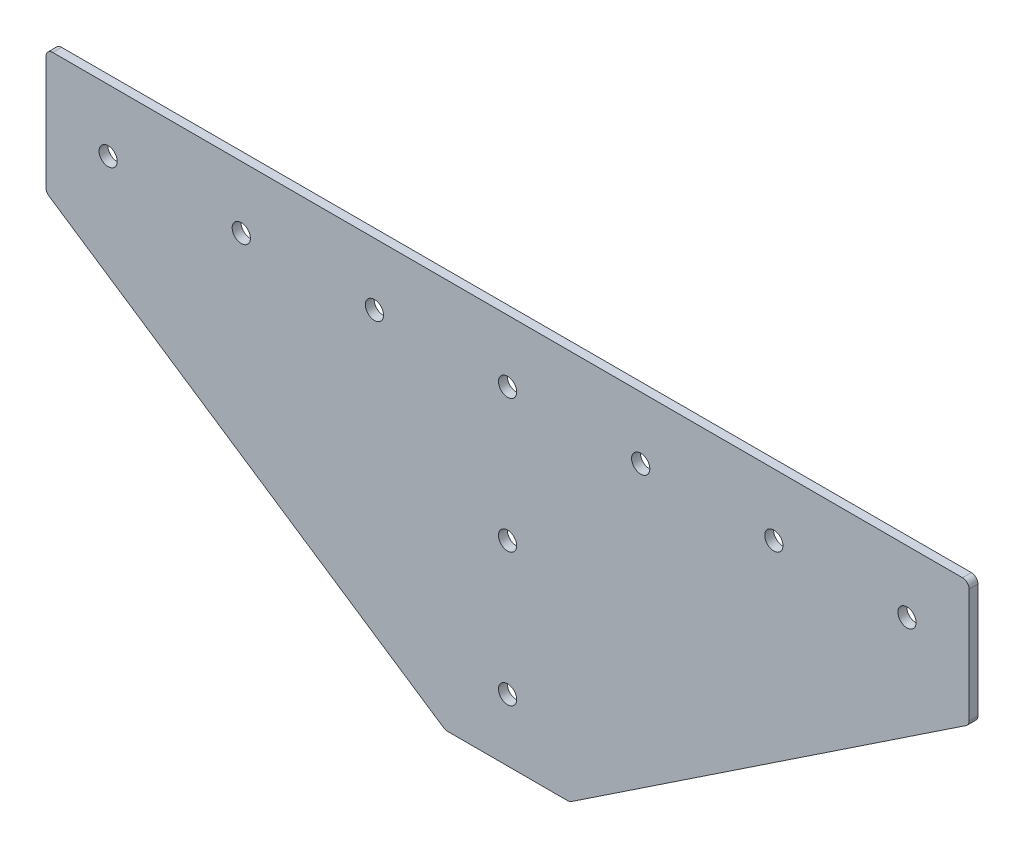
ISO-10303-21;
HEADER;
FILE_DESCRIPTION(('STEP AP214'),'2;1');
FILE_NAME('part.step','',(''),(''),'','','');
FILE_SCHEMA(('AUTOMOTIVE_DESIGN { 1 0 10303 214 1 1 1 1 }'));
ENDSEC;
DATA;
#1=APPLICATION_CONTEXT('core data for automotive mechanical design processes');
#2=APPLICATION_PROTOCOL_DEFINITION('international standard','automotive_design',2000,#1);
#3=PRODUCT_CONTEXT('',#1,'mechanical');
#4=PRODUCT('Part','Part','',(#3));
#5=PRODUCT_RELATED_PRODUCT_CATEGORY('part','',(#4));
#6=PRODUCT_DEFINITION_FORMATION('','',#4);
#7=PRODUCT_DEFINITION_CONTEXT('part definition',#1,'design');
#8=PRODUCT_DEFINITION('design','',#6,#7);
#9=PRODUCT_DEFINITION_SHAPE('','',#8);
#10=(LENGTH_UNIT() NAMED_UNIT(*) SI_UNIT(.MILLI.,.METRE.));
#11=(NAMED_UNIT(*) PLANE_ANGLE_UNIT() SI_UNIT($,.RADIAN.));
#12=(NAMED_UNIT(*) SI_UNIT($,.STERADIAN.) SOLID_ANGLE_UNIT());
#13=UNCERTAINTY_MEASURE_WITH_UNIT(LENGTH_MEASURE(1.E-05),#10,'distance_accuracy_value','');
#14=(GEOMETRIC_REPRESENTATION_CONTEXT(3) GLOBAL_UNCERTAINTY_ASSIGNED_CONTEXT((#13)) GLOBAL_UNIT_ASSIGNED_CONTEXT((#10,
#11,#12)) REPRESENTATION_CONTEXT('',''));
#15=CARTESIAN_POINT('',(0.,0.,0.));
#16=DIRECTION('',(0.,0.,1.));
#17=DIRECTION('',(1.,0.,0.));
#18=AXIS2_PLACEMENT_3D('',#15,#16,#17);
#19=CARTESIAN_POINT('',(0.,0.,4.));
#20=DIRECTION('',(0.,0.,1.));
#21=DIRECTION('',(1.,0.,0.));
#22=AXIS2_PLACEMENT_3D('',#19,#20,#21);
#23=PLANE('',#22);
#24=CARTESIAN_POINT('',(360.,0.,4.));
#25=DIRECTION('',(0.,0.,1.));
#26=DIRECTION('',(1.,0.,0.));
#27=AXIS2_PLACEMENT_3D('',#24,#25,#26);
#28=CIRCLE('',#27,4.09999999999999);
#29=CARTESIAN_POINT('',(364.1,0.,4.));
#30=VERTEX_POINT('',#29);
#31=EDGE_CURVE('E244',#30,#30,#28,.T.);
#32=ORIENTED_EDGE('',*,*,#31,.F.);
#33=EDGE_LOOP('',(#32));
#34=FACE_BOUND('',#33,.T.);
#35=CARTESIAN_POINT('',(240.,0.,4.));
#36=DIRECTION('',(0.,0.,1.));
#37=DIRECTION('',(1.,0.,0.));
#38=AXIS2_PLACEMENT_3D('',#35,#36,#37);
#39=CIRCLE('',#38,4.09999999999999);
#40=CARTESIAN_POINT('',(244.1,0.,4.));
#41=VERTEX_POINT('',#40);
#42=EDGE_CURVE('E232',#41,#41,#39,.T.);
#43=ORIENTED_EDGE('',*,*,#42,.F.);
#44=EDGE_LOOP('',(#43));
#45=FACE_BOUND('',#44,.T.);
#46=CARTESIAN_POINT('',(180.000000000001,-119.999999999999,4.));
#47=DIRECTION('',(0.,0.,1.));
#48=DIRECTION('',(1.,0.,0.));
#49=AXIS2_PLACEMENT_3D('',#46,#47,#48);
#50=CIRCLE('',#49,4.09999999999998);
#51=CARTESIAN_POINT('',(184.100000000001,-119.999999999999,4.));
#52=VERTEX_POINT('',#51);
#53=EDGE_CURVE('E220',#52,#52,#50,.T.);
#54=ORIENTED_EDGE('',*,*,#53,.F.);
#55=EDGE_LOOP('',(#54));
#56=FACE_BOUND('',#55,.T.);
#57=CARTESIAN_POINT('',(60.,0.,4.));
#58=DIRECTION('',(0.,0.,1.));
#59=DIRECTION('',(1.,0.,0.));
#60=AXIS2_PLACEMENT_3D('',#57,#58,#59);
#61=CIRCLE('',#60,4.09999999999999);
#62=CARTESIAN_POINT('',(64.1,0.,4.));
#63=VERTEX_POINT('',#62);
#64=EDGE_CURVE('E209',#63,#63,#61,.T.);
#65=ORIENTED_EDGE('',*,*,#64,.F.);
#66=EDGE_LOOP('',(#65));
#67=FACE_BOUND('',#66,.T.);
#68=DIRECTION('',(0.832050294337844,0.554700196225229,0.));
#69=VECTOR('',#68,1.);
#70=CARTESIAN_POINT('',(388.,-28.,4.));
#71=LINE('',#70,#69);
#72=CARTESIAN_POINT('',(208.75577367548,-147.496150883014,4.));
#73=VERTEX_POINT('',#72);
#74=CARTESIAN_POINT('',(386.664100588676,-28.8905996075496,4.));
#75=VERTEX_POINT('',#74);
#76=EDGE_CURVE('E266',#73,#75,#71,.T.);
#77=ORIENTED_EDGE('',*,*,#76,.T.);
#78=CARTESIAN_POINT('',(385.,-26.3944487245361,4.));
#79=DIRECTION('',(0.,0.,1.));
#80=DIRECTION('',(1.,0.,0.));
#81=AXIS2_PLACEMENT_3D('',#78,#79,#80);
#82=CIRCLE('',#81,3.);
#83=CARTESIAN_POINT('',(388.,-26.3944487245361,4.));
#84=VERTEX_POINT('',#83);
#85=EDGE_CURVE('E163',#75,#84,#82,.T.);
#86=ORIENTED_EDGE('',*,*,#85,.T.);
#87=DIRECTION('',(0.,1.,0.));
#88=VECTOR('',#87,1.);
#89=CARTESIAN_POINT('',(388.,28.,4.));
#90=LINE('',#89,#88);
#91=CARTESIAN_POINT('',(388.,25.,4.));
#92=VERTEX_POINT('',#91);
#93=EDGE_CURVE('E124',#84,#92,#90,.T.);
#94=ORIENTED_EDGE('',*,*,#93,.T.);
#95=CARTESIAN_POINT('',(385.,25.,4.));
#96=DIRECTION('',(0.,0.,1.));
#97=DIRECTION('',(1.,0.,0.));
#98=AXIS2_PLACEMENT_3D('',#95,#96,#97);
#99=CIRCLE('',#98,3.);
#100=CARTESIAN_POINT('',(385.,28.,4.));
#101=VERTEX_POINT('',#100);
#102=EDGE_CURVE('E36',#92,#101,#99,.T.);
#103=ORIENTED_EDGE('',*,*,#102,.T.);
#104=DIRECTION('',(-1.,0.,0.));
#105=VECTOR('',#104,1.);
#106=CARTESIAN_POINT('',(-28.,28.,4.));
#107=LINE('',#106,#105);
#108=CARTESIAN_POINT('',(-25.,28.,4.));
#109=VERTEX_POINT('',#108);
#110=EDGE_CURVE('E141',#101,#109,#107,.T.);
#111=ORIENTED_EDGE('',*,*,#110,.T.);
#112=CARTESIAN_POINT('',(-25.,25.,4.));
#113=DIRECTION('',(0.,0.,1.));
#114=DIRECTION('',(1.,0.,0.));
#115=AXIS2_PLACEMENT_3D('',#112,#113,#114);
#116=CIRCLE('',#115,3.);
#117=CARTESIAN_POINT('',(-28.,25.,4.));
#118=VERTEX_POINT('',#117);
#119=EDGE_CURVE('E155',#109,#118,#116,.T.);
#120=ORIENTED_EDGE('',*,*,#119,.T.);
#121=DIRECTION('',(0.,-1.,0.));
#122=VECTOR('',#121,1.);
#123=CARTESIAN_POINT('',(-28.,28.,4.));
#124=LINE('',#123,#122);
#125=CARTESIAN_POINT('',(-28.,-26.394448724536,4.));
#126=VERTEX_POINT('',#125);
#127=EDGE_CURVE('E134',#118,#126,#124,.T.);
#128=ORIENTED_EDGE('',*,*,#127,.T.);
#129=CARTESIAN_POINT('',(-25.,-26.394448724536,4.));
#130=DIRECTION('',(0.,0.,1.));
#131=DIRECTION('',(1.,0.,0.));
#132=AXIS2_PLACEMENT_3D('',#129,#130,#131);
#133=CIRCLE('',#132,3.);
#134=CARTESIAN_POINT('',(-26.6641005886757,-28.8905996075495,4.));
#135=VERTEX_POINT('',#134);
#136=EDGE_CURVE('E157',#126,#135,#133,.T.);
#137=ORIENTED_EDGE('',*,*,#136,.T.);
#138=DIRECTION('',(0.832050294337844,-0.554700196225229,0.));
#139=VECTOR('',#138,1.);
#140=CARTESIAN_POINT('',(-28.,-28.,4.));
#141=LINE('',#140,#139);
#142=CARTESIAN_POINT('',(151.24422632452,-147.496150883014,4.));
#143=VERTEX_POINT('',#142);
#144=EDGE_CURVE('E261',#135,#143,#141,.T.);
#145=ORIENTED_EDGE('',*,*,#144,.T.);
#146=CARTESIAN_POINT('',(152.908326913196,-145.,4.));
#147=DIRECTION('',(0.,0.,1.));
#148=DIRECTION('',(1.,0.,0.));
#149=AXIS2_PLACEMENT_3D('',#146,#147,#148);
#150=CIRCLE('',#149,3.);
#151=CARTESIAN_POINT('',(152.908326913196,-148.,4.));
#152=VERTEX_POINT('',#151);
#153=EDGE_CURVE('E159',#143,#152,#150,.T.);
#154=ORIENTED_EDGE('',*,*,#153,.T.);
#155=DIRECTION('',(1.,0.,0.));
#156=VECTOR('',#155,1.);
#157=CARTESIAN_POINT('',(152.,-148.,4.));
#158=LINE('',#157,#156);
#159=CARTESIAN_POINT('',(207.091673086804,-148.,4.));
#160=VERTEX_POINT('',#159);
#161=EDGE_CURVE('E195',#152,#160,#158,.T.);
#162=ORIENTED_EDGE('',*,*,#161,.T.);
#163=CARTESIAN_POINT('',(207.091673086804,-145.,4.));
#164=DIRECTION('',(0.,0.,1.));
#165=DIRECTION('',(1.,0.,0.));
#166=AXIS2_PLACEMENT_3D('',#163,#164,#165);
#167=CIRCLE('',#166,3.);
#168=EDGE_CURVE('E161',#160,#73,#167,.T.);
#169=ORIENTED_EDGE('',*,*,#168,.T.);
#170=EDGE_LOOP('',(#77,#86,#94,#103,#111,#120,#128,#137,#145,#154,#162,#169));
#171=FACE_BOUND('',#170,.T.);
#172=CARTESIAN_POINT('',(0.,0.,4.));
#173=DIRECTION('',(0.,0.,1.));
#174=DIRECTION('',(1.,0.,0.));
#175=AXIS2_PLACEMENT_3D('',#172,#173,#174);
#176=CIRCLE('',#175,4.1);
#177=CARTESIAN_POINT('',(4.1,0.,4.));
#178=VERTEX_POINT('',#177);
#179=EDGE_CURVE('E204',#178,#178,#176,.T.);
#180=ORIENTED_EDGE('',*,*,#179,.F.);
#181=EDGE_LOOP('',(#180));
#182=FACE_BOUND('',#181,.T.);
#183=CARTESIAN_POINT('',(120.,0.,4.));
#184=DIRECTION('',(0.,0.,1.));
#185=DIRECTION('',(1.,0.,0.));
#186=AXIS2_PLACEMENT_3D('',#183,#184,#185);
#187=CIRCLE('',#186,4.1);
#188=CARTESIAN_POINT('',(124.1,0.,4.));
#189=VERTEX_POINT('',#188);
#190=EDGE_CURVE('E214',#189,#189,#187,.T.);
#191=ORIENTED_EDGE('',*,*,#190,.F.);
#192=EDGE_LOOP('',(#191));
#193=FACE_BOUND('',#192,.T.);
#194=CARTESIAN_POINT('',(180.,0.,4.));
#195=DIRECTION('',(0.,0.,1.));
#196=DIRECTION('',(1.,0.,0.));
#197=AXIS2_PLACEMENT_3D('',#194,#195,#196);
#198=CIRCLE('',#197,4.09999999999999);
#199=CARTESIAN_POINT('',(184.1,0.,4.));
#200=VERTEX_POINT('',#199);
#201=EDGE_CURVE('E226',#200,#200,#198,.T.);
#202=ORIENTED_EDGE('',*,*,#201,.F.);
#203=EDGE_LOOP('',(#202));
#204=FACE_BOUND('',#203,.T.);
#205=CARTESIAN_POINT('',(300.,0.,4.));
#206=DIRECTION('',(0.,0.,1.));
#207=DIRECTION('',(1.,0.,0.));
#208=AXIS2_PLACEMENT_3D('',#205,#206,#207);
#209=CIRCLE('',#208,4.09999999999999);
#210=CARTESIAN_POINT('',(304.1,0.,4.));
#211=VERTEX_POINT('',#210);
#212=EDGE_CURVE('E238',#211,#211,#209,.T.);
#213=ORIENTED_EDGE('',*,*,#212,.F.);
#214=EDGE_LOOP('',(#213));
#215=FACE_BOUND('',#214,.T.);
#216=CARTESIAN_POINT('',(180.,-60.,4.));
#217=DIRECTION('',(0.,0.,1.));
#218=DIRECTION('',(1.,0.,0.));
#219=AXIS2_PLACEMENT_3D('',#216,#217,#218);
#220=CIRCLE('',#219,4.09999999999999);
#221=CARTESIAN_POINT('',(184.1,-60.,4.));
#222=VERTEX_POINT('',#221);
#223=EDGE_CURVE('E250',#222,#222,#220,.T.);
#224=ORIENTED_EDGE('',*,*,#223,.F.);
#225=EDGE_LOOP('',(#224));
#226=FACE_BOUND('',#225,.T.);
#227=ADVANCED_FACE('F16',(#34,#45,#56,#67,#171,#182,#193,#204,#215,#226),#23,.T.);
#228=CARTESIAN_POINT('',(0.,0.,0.));
#229=DIRECTION('',(0.,0.,1.));
#230=DIRECTION('',(1.,0.,0.));
#231=AXIS2_PLACEMENT_3D('',#228,#229,#230);
#232=PLANE('',#231);
#233=DIRECTION('',(0.,1.,0.));
#234=VECTOR('',#233,1.);
#235=CARTESIAN_POINT('',(388.,28.,0.));
#236=LINE('',#235,#234);
#237=CARTESIAN_POINT('',(388.,-26.3944487245361,0.));
#238=VERTEX_POINT('',#237);
#239=CARTESIAN_POINT('',(388.,25.,0.));
#240=VERTEX_POINT('',#239);
#241=EDGE_CURVE('E122',#238,#240,#236,.T.);
#242=ORIENTED_EDGE('',*,*,#241,.F.);
#243=CARTESIAN_POINT('',(385.,-26.3944487245361,0.));
#244=DIRECTION('',(0.,0.,1.));
#245=DIRECTION('',(1.,0.,0.));
#246=AXIS2_PLACEMENT_3D('',#243,#244,#245);
#247=CIRCLE('',#246,3.);
#248=CARTESIAN_POINT('',(386.664100588676,-28.8905996075496,0.));
#249=VERTEX_POINT('',#248);
#250=EDGE_CURVE('E105',#238,#249,#247,.F.);
#251=ORIENTED_EDGE('',*,*,#250,.T.);
#252=DIRECTION('',(-0.832050294337844,-0.554700196225229,0.));
#253=VECTOR('',#252,1.);
#254=CARTESIAN_POINT('',(388.,-28.,0.));
#255=LINE('',#254,#253);
#256=CARTESIAN_POINT('',(208.75577367548,-147.496150883014,0.));
#257=VERTEX_POINT('',#256);
#258=EDGE_CURVE('E264',#249,#257,#255,.T.);
#259=ORIENTED_EDGE('',*,*,#258,.T.);
#260=CARTESIAN_POINT('',(207.091673086804,-145.,0.));
#261=DIRECTION('',(0.,0.,1.));
#262=DIRECTION('',(1.,0.,0.));
#263=AXIS2_PLACEMENT_3D('',#260,#261,#262);
#264=CIRCLE('',#263,3.);
#265=CARTESIAN_POINT('',(207.091673086804,-148.,0.));
#266=VERTEX_POINT('',#265);
#267=EDGE_CURVE('E116',#257,#266,#264,.F.);
#268=ORIENTED_EDGE('',*,*,#267,.T.);
#269=DIRECTION('',(1.,0.,0.));
#270=VECTOR('',#269,1.);
#271=CARTESIAN_POINT('',(152.,-148.,0.));
#272=LINE('',#271,#270);
#273=CARTESIAN_POINT('',(152.908326913196,-148.,0.));
#274=VERTEX_POINT('',#273);
#275=EDGE_CURVE('E132',#274,#266,#272,.T.);
#276=ORIENTED_EDGE('',*,*,#275,.F.);
#277=CARTESIAN_POINT('',(152.908326913196,-145.,0.));
#278=DIRECTION('',(0.,0.,1.));
#279=DIRECTION('',(1.,0.,0.));
#280=AXIS2_PLACEMENT_3D('',#277,#278,#279);
#281=CIRCLE('',#280,3.);
#282=CARTESIAN_POINT('',(151.24422632452,-147.496150883014,0.));
#283=VERTEX_POINT('',#282);
#284=EDGE_CURVE('E148',#274,#283,#281,.F.);
#285=ORIENTED_EDGE('',*,*,#284,.T.);
#286=DIRECTION('',(-0.832050294337844,0.554700196225229,0.));
#287=VECTOR('',#286,1.);
#288=CARTESIAN_POINT('',(-28.,-28.,0.));
#289=LINE('',#288,#287);
#290=CARTESIAN_POINT('',(-26.6641005886757,-28.8905996075495,0.));
#291=VERTEX_POINT('',#290);
#292=EDGE_CURVE('E256',#283,#291,#289,.T.);
#293=ORIENTED_EDGE('',*,*,#292,.T.);
#294=CARTESIAN_POINT('',(-25.,-26.394448724536,0.));
#295=DIRECTION('',(0.,0.,1.));
#296=DIRECTION('',(1.,0.,0.));
#297=AXIS2_PLACEMENT_3D('',#294,#295,#296);
#298=CIRCLE('',#297,3.);
#299=CARTESIAN_POINT('',(-28.,-26.394448724536,0.));
#300=VERTEX_POINT('',#299);
#301=EDGE_CURVE('E146',#291,#300,#298,.F.);
#302=ORIENTED_EDGE('',*,*,#301,.T.);
#303=DIRECTION('',(0.,-1.,0.));
#304=VECTOR('',#303,1.);
#305=CARTESIAN_POINT('',(-28.,28.,0.));
#306=LINE('',#305,#304);
#307=CARTESIAN_POINT('',(-28.,25.,0.));
#308=VERTEX_POINT('',#307);
#309=EDGE_CURVE('E137',#308,#300,#306,.T.);
#310=ORIENTED_EDGE('',*,*,#309,.F.);
#311=CARTESIAN_POINT('',(-25.,25.,0.));
#312=DIRECTION('',(0.,0.,1.));
#313=DIRECTION('',(1.,0.,0.));
#314=AXIS2_PLACEMENT_3D('',#311,#312,#313);
#315=CIRCLE('',#314,3.);
#316=CARTESIAN_POINT('',(-25.,28.,0.));
#317=VERTEX_POINT('',#316);
#318=EDGE_CURVE('E144',#308,#317,#315,.F.);
#319=ORIENTED_EDGE('',*,*,#318,.T.);
#320=DIRECTION('',(-1.,0.,0.));
#321=VECTOR('',#320,1.);
#322=CARTESIAN_POINT('',(-28.,28.,0.));
#323=LINE('',#322,#321);
#324=CARTESIAN_POINT('',(385.,28.,0.));
#325=VERTEX_POINT('',#324);
#326=EDGE_CURVE('E131',#325,#317,#323,.T.);
#327=ORIENTED_EDGE('',*,*,#326,.F.);
#328=CARTESIAN_POINT('',(385.,25.,0.));
#329=DIRECTION('',(0.,0.,1.));
#330=DIRECTION('',(1.,0.,0.));
#331=AXIS2_PLACEMENT_3D('',#328,#329,#330);
#332=CIRCLE('',#331,3.);
#333=EDGE_CURVE('E125',#325,#240,#332,.F.);
#334=ORIENTED_EDGE('',*,*,#333,.T.);
#335=EDGE_LOOP('',(#242,#251,#259,#268,#276,#285,#293,#302,#310,#319,#327,#334));
#336=FACE_BOUND('',#335,.T.);
#337=CARTESIAN_POINT('',(0.,0.,0.));
#338=DIRECTION('',(0.,0.,1.));
#339=DIRECTION('',(1.,0.,0.));
#340=AXIS2_PLACEMENT_3D('',#337,#338,#339);
#341=CIRCLE('',#340,4.1);
#342=CARTESIAN_POINT('',(4.1,0.,0.));
#343=VERTEX_POINT('',#342);
#344=EDGE_CURVE('E200',#343,#343,#341,.T.);
#345=ORIENTED_EDGE('',*,*,#344,.T.);
#346=EDGE_LOOP('',(#345));
#347=FACE_BOUND('',#346,.T.);
#348=CARTESIAN_POINT('',(60.,0.,0.));
#349=DIRECTION('',(0.,0.,1.));
#350=DIRECTION('',(1.,0.,0.));
#351=AXIS2_PLACEMENT_3D('',#348,#349,#350);
#352=CIRCLE('',#351,4.09999999999999);
#353=CARTESIAN_POINT('',(64.1,0.,0.));
#354=VERTEX_POINT('',#353);
#355=EDGE_CURVE('E211',#354,#354,#352,.T.);
#356=ORIENTED_EDGE('',*,*,#355,.T.);
#357=EDGE_LOOP('',(#356));
#358=FACE_BOUND('',#357,.T.);
#359=CARTESIAN_POINT('',(120.,0.,0.));
#360=DIRECTION('',(0.,0.,1.));
#361=DIRECTION('',(1.,0.,0.));
#362=AXIS2_PLACEMENT_3D('',#359,#360,#361);
#363=CIRCLE('',#362,4.1);
#364=CARTESIAN_POINT('',(124.1,0.,0.));
#365=VERTEX_POINT('',#364);
#366=EDGE_CURVE('E217',#365,#365,#363,.T.);
#367=ORIENTED_EDGE('',*,*,#366,.T.);
#368=EDGE_LOOP('',(#367));
#369=FACE_BOUND('',#368,.T.);
#370=CARTESIAN_POINT('',(180.000000000001,-119.999999999999,0.));
#371=DIRECTION('',(0.,0.,1.));
#372=DIRECTION('',(1.,0.,0.));
#373=AXIS2_PLACEMENT_3D('',#370,#371,#372);
#374=CIRCLE('',#373,4.09999999999998);
#375=CARTESIAN_POINT('',(184.100000000001,-119.999999999999,0.));
#376=VERTEX_POINT('',#375);
#377=EDGE_CURVE('E223',#376,#376,#374,.T.);
#378=ORIENTED_EDGE('',*,*,#377,.T.);
#379=EDGE_LOOP('',(#378));
#380=FACE_BOUND('',#379,.T.);
#381=CARTESIAN_POINT('',(180.,0.,0.));
#382=DIRECTION('',(0.,0.,1.));
#383=DIRECTION('',(1.,0.,0.));
#384=AXIS2_PLACEMENT_3D('',#381,#382,#383);
#385=CIRCLE('',#384,4.09999999999999);
#386=CARTESIAN_POINT('',(184.1,0.,0.));
#387=VERTEX_POINT('',#386);
#388=EDGE_CURVE('E229',#387,#387,#385,.T.);
#389=ORIENTED_EDGE('',*,*,#388,.T.);
#390=EDGE_LOOP('',(#389));
#391=FACE_BOUND('',#390,.T.);
#392=CARTESIAN_POINT('',(240.,0.,0.));
#393=DIRECTION('',(0.,0.,1.));
#394=DIRECTION('',(1.,0.,0.));
#395=AXIS2_PLACEMENT_3D('',#392,#393,#394);
#396=CIRCLE('',#395,4.09999999999999);
#397=CARTESIAN_POINT('',(244.1,0.,0.));
#398=VERTEX_POINT('',#397);
#399=EDGE_CURVE('E235',#398,#398,#396,.T.);
#400=ORIENTED_EDGE('',*,*,#399,.T.);
#401=EDGE_LOOP('',(#400));
#402=FACE_BOUND('',#401,.T.);
#403=CARTESIAN_POINT('',(300.,0.,0.));
#404=DIRECTION('',(0.,0.,1.));
#405=DIRECTION('',(1.,0.,0.));
#406=AXIS2_PLACEMENT_3D('',#403,#404,#405);
#407=CIRCLE('',#406,4.09999999999999);
#408=CARTESIAN_POINT('',(304.1,0.,0.));
#409=VERTEX_POINT('',#408);
#410=EDGE_CURVE('E241',#409,#409,#407,.T.);
#411=ORIENTED_EDGE('',*,*,#410,.T.);
#412=EDGE_LOOP('',(#411));
#413=FACE_BOUND('',#412,.T.);
#414=CARTESIAN_POINT('',(360.,0.,0.));
#415=DIRECTION('',(0.,0.,1.));
#416=DIRECTION('',(1.,0.,0.));
#417=AXIS2_PLACEMENT_3D('',#414,#415,#416);
#418=CIRCLE('',#417,4.09999999999999);
#419=CARTESIAN_POINT('',(364.1,0.,0.));
#420=VERTEX_POINT('',#419);
#421=EDGE_CURVE('E247',#420,#420,#418,.T.);
#422=ORIENTED_EDGE('',*,*,#421,.T.);
#423=EDGE_LOOP('',(#422));
#424=FACE_BOUND('',#423,.T.);
#425=CARTESIAN_POINT('',(180.,-60.,0.));
#426=DIRECTION('',(0.,0.,1.));
#427=DIRECTION('',(1.,0.,0.));
#428=AXIS2_PLACEMENT_3D('',#425,#426,#427);
#429=CIRCLE('',#428,4.09999999999999);
#430=CARTESIAN_POINT('',(184.1,-60.,0.));
#431=VERTEX_POINT('',#430);
#432=EDGE_CURVE('E253',#431,#431,#429,.T.);
#433=ORIENTED_EDGE('',*,*,#432,.T.);
#434=EDGE_LOOP('',(#433));
#435=FACE_BOUND('',#434,.T.);
#436=ADVANCED_FACE('F128',(#336,#347,#358,#369,#380,#391,#402,#413,#424,#435),#232,.F.);
#437=CARTESIAN_POINT('',(-28.,28.,4.));
#438=DIRECTION('',(1.,0.,0.));
#439=DIRECTION('',(0.,1.,0.));
#440=AXIS2_PLACEMENT_3D('',#437,#438,#439);
#441=PLANE('',#440);
#442=ORIENTED_EDGE('',*,*,#309,.T.);
#443=DIRECTION('',(0.,0.,-1.));
#444=VECTOR('',#443,1.);
#445=CARTESIAN_POINT('',(-28.,-26.394448724536,4.));
#446=LINE('',#445,#444);
#447=EDGE_CURVE('E178',#300,#126,#446,.F.);
#448=ORIENTED_EDGE('',*,*,#447,.T.);
#449=ORIENTED_EDGE('',*,*,#127,.F.);
#450=DIRECTION('',(0.,0.,-1.));
#451=VECTOR('',#450,1.);
#452=CARTESIAN_POINT('',(-28.,25.,4.));
#453=LINE('',#452,#451);
#454=EDGE_CURVE('E175',#118,#308,#453,.T.);
#455=ORIENTED_EDGE('',*,*,#454,.T.);
#456=EDGE_LOOP('',(#442,#448,#449,#455));
#457=FACE_BOUND('',#456,.T.);
#458=ADVANCED_FACE('F191',(#457),#441,.F.);
#459=CARTESIAN_POINT('',(152.,-148.,4.));
#460=DIRECTION('',(0.,1.,0.));
#461=DIRECTION('',(0.,0.,1.));
#462=AXIS2_PLACEMENT_3D('',#459,#460,#461);
#463=PLANE('',#462);
#464=ORIENTED_EDGE('',*,*,#275,.T.);
#465=DIRECTION('',(0.,0.,-1.));
#466=VECTOR('',#465,1.);
#467=CARTESIAN_POINT('',(207.091673086804,-148.,4.));
#468=LINE('',#467,#466);
#469=EDGE_CURVE('E168',#266,#160,#468,.F.);
#470=ORIENTED_EDGE('',*,*,#469,.T.);
#471=ORIENTED_EDGE('',*,*,#161,.F.);
#472=DIRECTION('',(0.,0.,-1.));
#473=VECTOR('',#472,1.);
#474=CARTESIAN_POINT('',(152.908326913196,-148.,0.));
#475=LINE('',#474,#473);
#476=EDGE_CURVE('E165',#152,#274,#475,.T.);
#477=ORIENTED_EDGE('',*,*,#476,.T.);
#478=EDGE_LOOP('',(#464,#470,#471,#477));
#479=FACE_BOUND('',#478,.T.);
#480=ADVANCED_FACE('F279',(#479),#463,.F.);
#481=CARTESIAN_POINT('',(388.,28.,4.));
#482=DIRECTION('',(-1.,0.,0.));
#483=DIRECTION('',(0.,0.,1.));
#484=AXIS2_PLACEMENT_3D('',#481,#482,#483);
#485=PLANE('',#484);
#486=ORIENTED_EDGE('',*,*,#93,.F.);
#487=DIRECTION('',(0.,0.,-1.));
#488=VECTOR('',#487,1.);
#489=CARTESIAN_POINT('',(388.,-26.3944487245361,0.));
#490=LINE('',#489,#488);
#491=EDGE_CURVE('E109',#84,#238,#490,.T.);
#492=ORIENTED_EDGE('',*,*,#491,.T.);
#493=ORIENTED_EDGE('',*,*,#241,.T.);
#494=DIRECTION('',(0.,0.,-1.));
#495=VECTOR('',#494,1.);
#496=CARTESIAN_POINT('',(388.,25.,4.));
#497=LINE('',#496,#495);
#498=EDGE_CURVE('E126',#240,#92,#497,.F.);
#499=ORIENTED_EDGE('',*,*,#498,.T.);
#500=EDGE_LOOP('',(#486,#492,#493,#499));
#501=FACE_BOUND('',#500,.T.);
#502=ADVANCED_FACE('F121',(#501),#485,.F.);
#503=CARTESIAN_POINT('',(-28.,28.,4.));
#504=DIRECTION('',(0.,-1.,0.));
#505=DIRECTION('',(1.,0.,0.));
#506=AXIS2_PLACEMENT_3D('',#503,#504,#505);
#507=PLANE('',#506);
#508=ORIENTED_EDGE('',*,*,#326,.T.);
#509=DIRECTION('',(0.,0.,-1.));
#510=VECTOR('',#509,1.);
#511=CARTESIAN_POINT('',(-25.,28.,4.));
#512=LINE('',#511,#510);
#513=EDGE_CURVE('E10',#317,#109,#512,.F.);
#514=ORIENTED_EDGE('',*,*,#513,.T.);
#515=ORIENTED_EDGE('',*,*,#110,.F.);
#516=DIRECTION('',(0.,0.,-1.));
#517=VECTOR('',#516,1.);
#518=CARTESIAN_POINT('',(385.,28.,4.));
#519=LINE('',#518,#517);
#520=EDGE_CURVE('E24',#101,#325,#519,.T.);
#521=ORIENTED_EDGE('',*,*,#520,.T.);
#522=EDGE_LOOP('',(#508,#514,#515,#521));
#523=FACE_BOUND('',#522,.T.);
#524=ADVANCED_FACE('F181',(#523),#507,.F.);
#525=CARTESIAN_POINT('',(0.,0.,4.));
#526=DIRECTION('',(0.,0.,-1.));
#527=DIRECTION('',(-1.,0.,0.));
#528=AXIS2_PLACEMENT_3D('',#525,#526,#527);
#529=CYLINDRICAL_SURFACE('',#528,4.1);
#530=ORIENTED_EDGE('',*,*,#179,.T.);
#531=EDGE_LOOP('',(#530));
#532=FACE_BOUND('',#531,.T.);
#533=ORIENTED_EDGE('',*,*,#344,.F.);
#534=EDGE_LOOP('',(#533));
#535=FACE_BOUND('',#534,.T.);
#536=ADVANCED_FACE('F311',(#532,#535),#529,.F.);
#537=CARTESIAN_POINT('',(60.,0.,4.));
#538=DIRECTION('',(0.,0.,-1.));
#539=DIRECTION('',(-1.,0.,0.));
#540=AXIS2_PLACEMENT_3D('',#537,#538,#539);
#541=CYLINDRICAL_SURFACE('',#540,4.09999999999999);
#542=ORIENTED_EDGE('',*,*,#64,.T.);
#543=EDGE_LOOP('',(#542));
#544=FACE_BOUND('',#543,.T.);
#545=ORIENTED_EDGE('',*,*,#355,.F.);
#546=EDGE_LOOP('',(#545));
#547=FACE_BOUND('',#546,.T.);
#548=ADVANCED_FACE('F386',(#544,#547),#541,.F.);
#549=CARTESIAN_POINT('',(120.,0.,4.));
#550=DIRECTION('',(0.,0.,-1.));
#551=DIRECTION('',(-1.,0.,0.));
#552=AXIS2_PLACEMENT_3D('',#549,#550,#551);
#553=CYLINDRICAL_SURFACE('',#552,4.1);
#554=ORIENTED_EDGE('',*,*,#190,.T.);
#555=EDGE_LOOP('',(#554));
#556=FACE_BOUND('',#555,.T.);
#557=ORIENTED_EDGE('',*,*,#366,.F.);
#558=EDGE_LOOP('',(#557));
#559=FACE_BOUND('',#558,.T.);
#560=ADVANCED_FACE('F394',(#556,#559),#553,.F.);
#561=CARTESIAN_POINT('',(180.000000000001,-119.999999999999,4.));
#562=DIRECTION('',(0.,0.,-1.));
#563=DIRECTION('',(-1.,0.,0.));
#564=AXIS2_PLACEMENT_3D('',#561,#562,#563);
#565=CYLINDRICAL_SURFACE('',#564,4.09999999999998);
#566=ORIENTED_EDGE('',*,*,#53,.T.);
#567=EDGE_LOOP('',(#566));
#568=FACE_BOUND('',#567,.T.);
#569=ORIENTED_EDGE('',*,*,#377,.F.);
#570=EDGE_LOOP('',(#569));
#571=FACE_BOUND('',#570,.T.);
#572=ADVANCED_FACE('F402',(#568,#571),#565,.F.);
#573=CARTESIAN_POINT('',(180.,0.,4.));
#574=DIRECTION('',(0.,0.,-1.));
#575=DIRECTION('',(-1.,0.,0.));
#576=AXIS2_PLACEMENT_3D('',#573,#574,#575);
#577=CYLINDRICAL_SURFACE('',#576,4.09999999999999);
#578=ORIENTED_EDGE('',*,*,#201,.T.);
#579=EDGE_LOOP('',(#578));
#580=FACE_BOUND('',#579,.T.);
#581=ORIENTED_EDGE('',*,*,#388,.F.);
#582=EDGE_LOOP('',(#581));
#583=FACE_BOUND('',#582,.T.);
#584=ADVANCED_FACE('F411',(#580,#583),#577,.F.);
#585=CARTESIAN_POINT('',(240.,0.,4.));
#586=DIRECTION('',(0.,0.,-1.));
#587=DIRECTION('',(-1.,0.,0.));
#588=AXIS2_PLACEMENT_3D('',#585,#586,#587);
#589=CYLINDRICAL_SURFACE('',#588,4.09999999999999);
#590=ORIENTED_EDGE('',*,*,#42,.T.);
#591=EDGE_LOOP('',(#590));
#592=FACE_BOUND('',#591,.T.);
#593=ORIENTED_EDGE('',*,*,#399,.F.);
#594=EDGE_LOOP('',(#593));
#595=FACE_BOUND('',#594,.T.);
#596=ADVANCED_FACE('F420',(#592,#595),#589,.F.);
#597=CARTESIAN_POINT('',(300.,0.,4.));
#598=DIRECTION('',(0.,0.,-1.));
#599=DIRECTION('',(-1.,0.,0.));
#600=AXIS2_PLACEMENT_3D('',#597,#598,#599);
#601=CYLINDRICAL_SURFACE('',#600,4.09999999999999);
#602=ORIENTED_EDGE('',*,*,#212,.T.);
#603=EDGE_LOOP('',(#602));
#604=FACE_BOUND('',#603,.T.);
#605=ORIENTED_EDGE('',*,*,#410,.F.);
#606=EDGE_LOOP('',(#605));
#607=FACE_BOUND('',#606,.T.);
#608=ADVANCED_FACE('F429',(#604,#607),#601,.F.);
#609=CARTESIAN_POINT('',(360.,0.,4.));
#610=DIRECTION('',(0.,0.,-1.));
#611=DIRECTION('',(-1.,0.,0.));
#612=AXIS2_PLACEMENT_3D('',#609,#610,#611);
#613=CYLINDRICAL_SURFACE('',#612,4.09999999999999);
#614=ORIENTED_EDGE('',*,*,#31,.T.);
#615=EDGE_LOOP('',(#614));
#616=FACE_BOUND('',#615,.T.);
#617=ORIENTED_EDGE('',*,*,#421,.F.);
#618=EDGE_LOOP('',(#617));
#619=FACE_BOUND('',#618,.T.);
#620=ADVANCED_FACE('F438',(#616,#619),#613,.F.);
#621=CARTESIAN_POINT('',(180.,-60.,4.));
#622=DIRECTION('',(0.,0.,-1.));
#623=DIRECTION('',(-1.,0.,0.));
#624=AXIS2_PLACEMENT_3D('',#621,#622,#623);
#625=CYLINDRICAL_SURFACE('',#624,4.09999999999999);
#626=ORIENTED_EDGE('',*,*,#223,.T.);
#627=EDGE_LOOP('',(#626));
#628=FACE_BOUND('',#627,.T.);
#629=ORIENTED_EDGE('',*,*,#432,.F.);
#630=EDGE_LOOP('',(#629));
#631=FACE_BOUND('',#630,.T.);
#632=ADVANCED_FACE('F377',(#628,#631),#625,.F.);
#633=CARTESIAN_POINT('',(-28.,-28.,-216.333076527839));
#634=DIRECTION('',(-0.554700196225229,-0.832050294337844,0.));
#635=DIRECTION('',(0.832050294337844,-0.554700196225229,0.));
#636=AXIS2_PLACEMENT_3D('',#633,#634,#635);
#637=PLANE('',#636);
#638=ORIENTED_EDGE('',*,*,#292,.F.);
#639=DIRECTION('',(0.,0.,-1.));
#640=VECTOR('',#639,1.);
#641=CARTESIAN_POINT('',(151.24422632452,-147.496150883014,4.));
#642=LINE('',#641,#640);
#643=EDGE_CURVE('E173',#283,#143,#642,.F.);
#644=ORIENTED_EDGE('',*,*,#643,.T.);
#645=ORIENTED_EDGE('',*,*,#144,.F.);
#646=DIRECTION('',(0.,0.,-1.));
#647=VECTOR('',#646,1.);
#648=CARTESIAN_POINT('',(-26.6641005886757,-28.8905996075495,0.));
#649=LINE('',#648,#647);
#650=EDGE_CURVE('E170',#135,#291,#649,.T.);
#651=ORIENTED_EDGE('',*,*,#650,.T.);
#652=EDGE_LOOP('',(#638,#644,#645,#651));
#653=FACE_BOUND('',#652,.T.);
#654=ADVANCED_FACE('F288',(#653),#637,.T.);
#655=CARTESIAN_POINT('',(388.,-28.,-216.333076527839));
#656=DIRECTION('',(0.554700196225229,-0.832050294337844,0.));
#657=DIRECTION('',(0.832050294337844,0.554700196225229,0.));
#658=AXIS2_PLACEMENT_3D('',#655,#656,#657);
#659=PLANE('',#658);
#660=ORIENTED_EDGE('',*,*,#258,.F.);
#661=DIRECTION('',(0.,0.,-1.));
#662=VECTOR('',#661,1.);
#663=CARTESIAN_POINT('',(386.664100588676,-28.8905996075496,4.));
#664=LINE('',#663,#662);
#665=EDGE_CURVE('E110',#249,#75,#664,.F.);
#666=ORIENTED_EDGE('',*,*,#665,.T.);
#667=ORIENTED_EDGE('',*,*,#76,.F.);
#668=DIRECTION('',(0.,0.,-1.));
#669=VECTOR('',#668,1.);
#670=CARTESIAN_POINT('',(208.75577367548,-147.496150883014,0.));
#671=LINE('',#670,#669);
#672=EDGE_CURVE('E115',#73,#257,#671,.T.);
#673=ORIENTED_EDGE('',*,*,#672,.T.);
#674=EDGE_LOOP('',(#660,#666,#667,#673));
#675=FACE_BOUND('',#674,.T.);
#676=ADVANCED_FACE('F273',(#675),#659,.T.);
#677=CARTESIAN_POINT('',(385.,-26.3944487245361,4.));
#678=DIRECTION('',(0.,0.,1.));
#679=DIRECTION('',(1.,0.,0.));
#680=AXIS2_PLACEMENT_3D('',#677,#678,#679);
#681=CYLINDRICAL_SURFACE('',#680,3.);
#682=ORIENTED_EDGE('',*,*,#85,.F.);
#683=ORIENTED_EDGE('',*,*,#665,.F.);
#684=ORIENTED_EDGE('',*,*,#250,.F.);
#685=ORIENTED_EDGE('',*,*,#491,.F.);
#686=EDGE_LOOP('',(#682,#683,#684,#685));
#687=FACE_BOUND('',#686,.T.);
#688=ADVANCED_FACE('F108',(#687),#681,.T.);
#689=CARTESIAN_POINT('',(207.091673086804,-145.,-216.333076527839));
#690=DIRECTION('',(0.,0.,1.));
#691=DIRECTION('',(1.,0.,0.));
#692=AXIS2_PLACEMENT_3D('',#689,#690,#691);
#693=CYLINDRICAL_SURFACE('',#692,3.);
#694=ORIENTED_EDGE('',*,*,#168,.F.);
#695=ORIENTED_EDGE('',*,*,#469,.F.);
#696=ORIENTED_EDGE('',*,*,#267,.F.);
#697=ORIENTED_EDGE('',*,*,#672,.F.);
#698=EDGE_LOOP('',(#694,#695,#696,#697));
#699=FACE_BOUND('',#698,.T.);
#700=ADVANCED_FACE('F275',(#699),#693,.T.);
#701=CARTESIAN_POINT('',(152.908326913196,-145.,4.));
#702=DIRECTION('',(0.,0.,1.));
#703=DIRECTION('',(1.,0.,0.));
#704=AXIS2_PLACEMENT_3D('',#701,#702,#703);
#705=CYLINDRICAL_SURFACE('',#704,3.);
#706=ORIENTED_EDGE('',*,*,#153,.F.);
#707=ORIENTED_EDGE('',*,*,#643,.F.);
#708=ORIENTED_EDGE('',*,*,#284,.F.);
#709=ORIENTED_EDGE('',*,*,#476,.F.);
#710=EDGE_LOOP('',(#706,#707,#708,#709));
#711=FACE_BOUND('',#710,.T.);
#712=ADVANCED_FACE('F284',(#711),#705,.T.);
#713=CARTESIAN_POINT('',(-25.,-26.394448724536,-216.333076527839));
#714=DIRECTION('',(0.,0.,1.));
#715=DIRECTION('',(1.,0.,0.));
#716=AXIS2_PLACEMENT_3D('',#713,#714,#715);
#717=CYLINDRICAL_SURFACE('',#716,3.);
#718=ORIENTED_EDGE('',*,*,#136,.F.);
#719=ORIENTED_EDGE('',*,*,#447,.F.);
#720=ORIENTED_EDGE('',*,*,#301,.F.);
#721=ORIENTED_EDGE('',*,*,#650,.F.);
#722=EDGE_LOOP('',(#718,#719,#720,#721));
#723=FACE_BOUND('',#722,.T.);
#724=ADVANCED_FACE('F292',(#723),#717,.T.);
#725=CARTESIAN_POINT('',(-25.,25.,4.));
#726=DIRECTION('',(0.,0.,-1.));
#727=DIRECTION('',(-1.,0.,0.));
#728=AXIS2_PLACEMENT_3D('',#725,#726,#727);
#729=CYLINDRICAL_SURFACE('',#728,3.);
#730=ORIENTED_EDGE('',*,*,#119,.F.);
#731=ORIENTED_EDGE('',*,*,#513,.F.);
#732=ORIENTED_EDGE('',*,*,#318,.F.);
#733=ORIENTED_EDGE('',*,*,#454,.F.);
#734=EDGE_LOOP('',(#730,#731,#732,#733));
#735=FACE_BOUND('',#734,.T.);
#736=ADVANCED_FACE('F188',(#735),#729,.T.);
#737=CARTESIAN_POINT('',(385.,25.,4.));
#738=DIRECTION('',(0.,0.,-1.));
#739=DIRECTION('',(-1.,0.,0.));
#740=AXIS2_PLACEMENT_3D('',#737,#738,#739);
#741=CYLINDRICAL_SURFACE('',#740,3.);
#742=ORIENTED_EDGE('',*,*,#102,.F.);
#743=ORIENTED_EDGE('',*,*,#498,.F.);
#744=ORIENTED_EDGE('',*,*,#333,.F.);
#745=ORIENTED_EDGE('',*,*,#520,.F.);
#746=EDGE_LOOP('',(#742,#743,#744,#745));
#747=FACE_BOUND('',#746,.T.);
#748=ADVANCED_FACE('F18',(#747),#741,.T.);
#749=CLOSED_SHELL('',(#227,#436,#458,#480,#502,#524,#536,#548,#560,#572,#584,#596,#608,#620,
#632,#654,#676,#688,#700,#712,#724,#736,#748));
#750=MANIFOLD_SOLID_BREP('B1',#749);
#751=ADVANCED_BREP_SHAPE_REPRESENTATION('',(#18,#750),#14);
#752=SHAPE_DEFINITION_REPRESENTATION(#9,#751);
ENDSEC;
END-ISO-10303-21;
